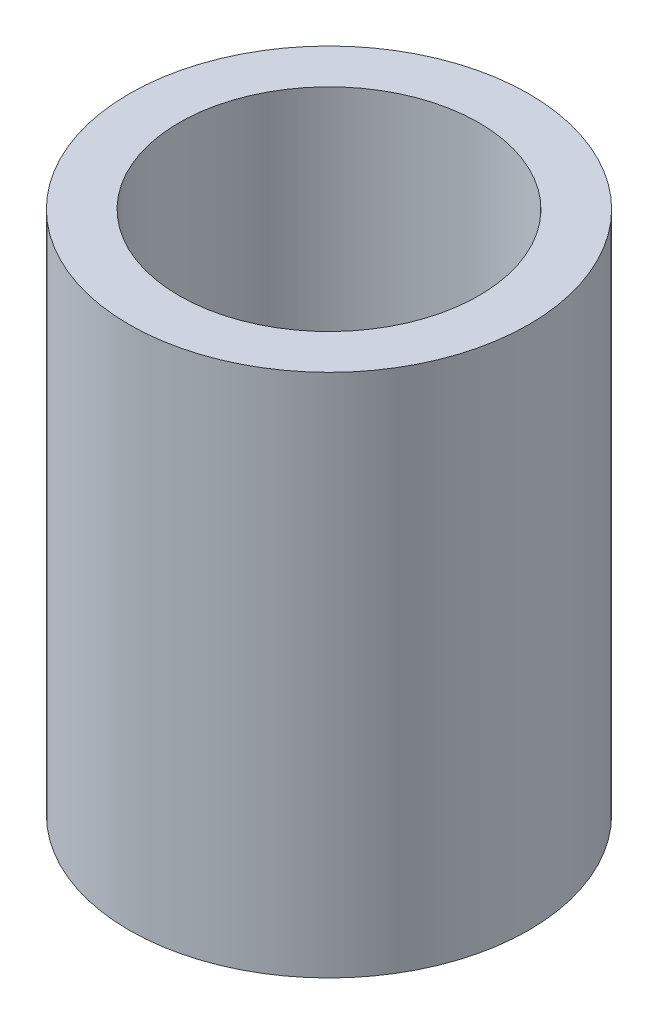
ISO-10303-21;
HEADER;
FILE_DESCRIPTION(('STEP AP214'),'2;1');
FILE_NAME('part.step','',(''),(''),'','','');
FILE_SCHEMA(('AUTOMOTIVE_DESIGN { 1 0 10303 214 1 1 1 1 }'));
ENDSEC;
DATA;
#1=APPLICATION_CONTEXT('core data for automotive mechanical design processes');
#2=APPLICATION_PROTOCOL_DEFINITION('international standard','automotive_design',2000,#1);
#3=PRODUCT_CONTEXT('',#1,'mechanical');
#4=PRODUCT('Part','Part','',(#3));
#5=PRODUCT_RELATED_PRODUCT_CATEGORY('part','',(#4));
#6=PRODUCT_DEFINITION_FORMATION('','',#4);
#7=PRODUCT_DEFINITION_CONTEXT('part definition',#1,'design');
#8=PRODUCT_DEFINITION('design','',#6,#7);
#9=PRODUCT_DEFINITION_SHAPE('','',#8);
#10=(LENGTH_UNIT() NAMED_UNIT(*) SI_UNIT(.MILLI.,.METRE.));
#11=(NAMED_UNIT(*) PLANE_ANGLE_UNIT() SI_UNIT($,.RADIAN.));
#12=(NAMED_UNIT(*) SI_UNIT($,.STERADIAN.) SOLID_ANGLE_UNIT());
#13=UNCERTAINTY_MEASURE_WITH_UNIT(LENGTH_MEASURE(1.E-05),#10,'distance_accuracy_value','');
#14=(GEOMETRIC_REPRESENTATION_CONTEXT(3) GLOBAL_UNCERTAINTY_ASSIGNED_CONTEXT((#13)) GLOBAL_UNIT_ASSIGNED_CONTEXT((#10,
#11,#12)) REPRESENTATION_CONTEXT('',''));
#15=CARTESIAN_POINT('',(0.,0.,0.));
#16=DIRECTION('',(0.,0.,1.));
#17=DIRECTION('',(1.,0.,0.));
#18=AXIS2_PLACEMENT_3D('',#15,#16,#17);
#19=CARTESIAN_POINT('',(0.,0.,0.));
#20=DIRECTION('',(0.,-1.,0.));
#21=DIRECTION('',(0.,0.,-1.));
#22=AXIS2_PLACEMENT_3D('',#19,#20,#21);
#23=CYLINDRICAL_SURFACE('',#22,32.);
#24=CARTESIAN_POINT('',(0.,0.,0.));
#25=DIRECTION('',(0.,-1.,0.));
#26=DIRECTION('',(0.,0.,-1.));
#27=AXIS2_PLACEMENT_3D('',#24,#25,#26);
#28=CIRCLE('',#27,32.);
#29=CARTESIAN_POINT('',(0.,0.,-32.));
#30=VERTEX_POINT('',#29);
#31=EDGE_CURVE('E10',#30,#30,#28,.T.);
#32=ORIENTED_EDGE('',*,*,#31,.F.);
#33=EDGE_LOOP('',(#32));
#34=FACE_BOUND('',#33,.T.);
#35=CARTESIAN_POINT('',(0.,83.9840268711891,0.));
#36=DIRECTION('',(0.,-1.,0.));
#37=DIRECTION('',(0.,0.,-1.));
#38=AXIS2_PLACEMENT_3D('',#35,#36,#37);
#39=CIRCLE('',#38,32.);
#40=CARTESIAN_POINT('',(0.,83.9840268711891,-32.));
#41=VERTEX_POINT('',#40);
#42=EDGE_CURVE('E49',#41,#41,#39,.T.);
#43=ORIENTED_EDGE('',*,*,#42,.T.);
#44=EDGE_LOOP('',(#43));
#45=FACE_BOUND('',#44,.T.);
#46=ADVANCED_FACE('F35',(#34,#45),#23,.T.);
#47=CARTESIAN_POINT('',(0.,0.,0.));
#48=DIRECTION('',(0.,1.,0.));
#49=DIRECTION('',(0.,0.,1.));
#50=AXIS2_PLACEMENT_3D('',#47,#48,#49);
#51=PLANE('',#50);
#52=CARTESIAN_POINT('',(0.,0.,0.));
#53=DIRECTION('',(0.,-1.,0.));
#54=DIRECTION('',(0.,0.,-1.));
#55=AXIS2_PLACEMENT_3D('',#52,#53,#54);
#56=CIRCLE('',#55,24.);
#57=CARTESIAN_POINT('',(0.,0.,-24.));
#58=VERTEX_POINT('',#57);
#59=EDGE_CURVE('E41',#58,#58,#56,.T.);
#60=ORIENTED_EDGE('',*,*,#59,.F.);
#61=EDGE_LOOP('',(#60));
#62=FACE_BOUND('',#61,.T.);
#63=ORIENTED_EDGE('',*,*,#31,.T.);
#64=EDGE_LOOP('',(#63));
#65=FACE_BOUND('',#64,.T.);
#66=ADVANCED_FACE('F64',(#62,#65),#51,.F.);
#67=CARTESIAN_POINT('',(0.,0.,0.));
#68=DIRECTION('',(0.,-1.,0.));
#69=DIRECTION('',(0.,0.,-1.));
#70=AXIS2_PLACEMENT_3D('',#67,#68,#69);
#71=CYLINDRICAL_SURFACE('',#70,24.);
#72=CARTESIAN_POINT('',(0.,83.9840268711891,0.));
#73=DIRECTION('',(0.,-1.,0.));
#74=DIRECTION('',(0.,0.,-1.));
#75=AXIS2_PLACEMENT_3D('',#72,#73,#74);
#76=CIRCLE('',#75,24.);
#77=CARTESIAN_POINT('',(0.,83.9840268711891,-24.));
#78=VERTEX_POINT('',#77);
#79=EDGE_CURVE('E45',#78,#78,#76,.T.);
#80=ORIENTED_EDGE('',*,*,#79,.F.);
#81=EDGE_LOOP('',(#80));
#82=FACE_BOUND('',#81,.T.);
#83=ORIENTED_EDGE('',*,*,#59,.T.);
#84=EDGE_LOOP('',(#83));
#85=FACE_BOUND('',#84,.T.);
#86=ADVANCED_FACE('F59',(#82,#85),#71,.F.);
#87=CARTESIAN_POINT('',(0.,83.9840268711891,0.));
#88=DIRECTION('',(0.,-1.,0.));
#89=DIRECTION('',(0.,0.,-1.));
#90=AXIS2_PLACEMENT_3D('',#87,#88,#89);
#91=PLANE('',#90);
#92=ORIENTED_EDGE('',*,*,#42,.F.);
#93=EDGE_LOOP('',(#92));
#94=FACE_BOUND('',#93,.T.);
#95=ORIENTED_EDGE('',*,*,#79,.T.);
#96=EDGE_LOOP('',(#95));
#97=FACE_BOUND('',#96,.T.);
#98=ADVANCED_FACE('F56',(#94,#97),#91,.F.);
#99=CLOSED_SHELL('',(#46,#66,#86,#98));
#100=MANIFOLD_SOLID_BREP('B2',#99);
#101=ADVANCED_BREP_SHAPE_REPRESENTATION('',(#18,#100),#14);
#102=SHAPE_DEFINITION_REPRESENTATION(#9,#101);
ENDSEC;
END-ISO-10303-21;
